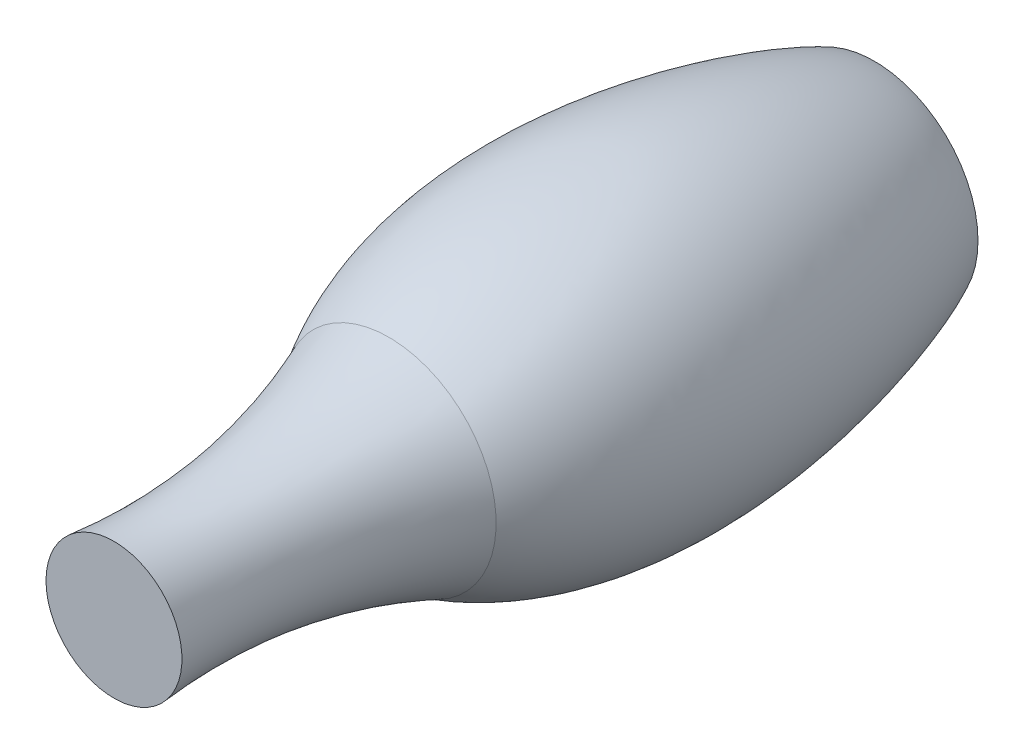
ISO-10303-21;
HEADER;
FILE_DESCRIPTION(('STEP AP214'),'2;1');
FILE_NAME('part.step','',(''),(''),'','','');
FILE_SCHEMA(('AUTOMOTIVE_DESIGN { 1 0 10303 214 1 1 1 1 }'));
ENDSEC;
DATA;
#1=APPLICATION_CONTEXT('core data for automotive mechanical design processes');
#2=APPLICATION_PROTOCOL_DEFINITION('international standard','automotive_design',2000,#1);
#3=PRODUCT_CONTEXT('',#1,'mechanical');
#4=PRODUCT('Part','Part','',(#3));
#5=PRODUCT_RELATED_PRODUCT_CATEGORY('part','',(#4));
#6=PRODUCT_DEFINITION_FORMATION('','',#4);
#7=PRODUCT_DEFINITION_CONTEXT('part definition',#1,'design');
#8=PRODUCT_DEFINITION('design','',#6,#7);
#9=PRODUCT_DEFINITION_SHAPE('','',#8);
#10=(LENGTH_UNIT() NAMED_UNIT(*) SI_UNIT(.MILLI.,.METRE.));
#11=(NAMED_UNIT(*) PLANE_ANGLE_UNIT() SI_UNIT($,.RADIAN.));
#12=(NAMED_UNIT(*) SI_UNIT($,.STERADIAN.) SOLID_ANGLE_UNIT());
#13=UNCERTAINTY_MEASURE_WITH_UNIT(LENGTH_MEASURE(1.E-05),#10,'distance_accuracy_value','');
#14=(GEOMETRIC_REPRESENTATION_CONTEXT(3) GLOBAL_UNCERTAINTY_ASSIGNED_CONTEXT((#13)) GLOBAL_UNIT_ASSIGNED_CONTEXT((#10,
#11,#12)) REPRESENTATION_CONTEXT('',''));
#15=CARTESIAN_POINT('',(0.,0.,0.));
#16=DIRECTION('',(0.,0.,1.));
#17=DIRECTION('',(1.,0.,0.));
#18=AXIS2_PLACEMENT_3D('',#15,#16,#17);
#19=CARTESIAN_POINT('',(983.947861402772,0.,11007.958646251));
#20=DIRECTION('',(0.,0.,-1.));
#21=DIRECTION('',(-1.,0.,0.));
#22=AXIS2_PLACEMENT_3D('',#19,#20,#21);
#23=PLANE('',#22);
#24=CARTESIAN_POINT('',(0.,0.,11007.958646251));
#25=DIRECTION('',(0.,0.,-1.));
#26=DIRECTION('',(-1.,0.,0.));
#27=AXIS2_PLACEMENT_3D('',#24,#25,#26);
#28=CIRCLE('',#27,983.947861402772);
#29=CARTESIAN_POINT('',(-983.947861402772,0.,11007.958646251));
#30=VERTEX_POINT('',#29);
#31=EDGE_CURVE('E10',#30,#30,#28,.T.);
#32=ORIENTED_EDGE('',*,*,#31,.F.);
#33=EDGE_LOOP('',(#32));
#34=FACE_BOUND('',#33,.T.);
#35=ADVANCED_FACE('F33',(#34),#23,.F.);
#36=CARTESIAN_POINT('',(983.947861402772,0.,11007.958646251));
#37=CARTESIAN_POINT('',(778.024635439564,0.,8933.8565343658));
#38=CARTESIAN_POINT('',(1552.78501070839,0.,7028.32632189743));
#39=B_SPLINE_CURVE_WITH_KNOTS('',2,(#36,#37,#38),.UNSPECIFIED.,.F.,.F.,(3,3),(0.,1.),.UNSPECIFIED.);
#40=CARTESIAN_POINT('',(0.,0.,0.));
#41=DIRECTION('',(0.,0.,-1.));
#42=AXIS1_PLACEMENT('',#40,#41);
#43=SURFACE_OF_REVOLUTION('',#39,#42);
#44=CARTESIAN_POINT('',(0.,0.,7028.32632189743));
#45=DIRECTION('',(0.,0.,-1.));
#46=DIRECTION('',(-1.,0.,0.));
#47=AXIS2_PLACEMENT_3D('',#44,#45,#46);
#48=CIRCLE('',#47,1552.78501070839);
#49=CARTESIAN_POINT('',(-1552.78501070839,0.,7028.32632189743));
#50=VERTEX_POINT('',#49);
#51=EDGE_CURVE('E39',#50,#50,#48,.T.);
#52=ORIENTED_EDGE('',*,*,#51,.F.);
#53=EDGE_LOOP('',(#52));
#54=FACE_BOUND('',#53,.T.);
#55=ORIENTED_EDGE('',*,*,#31,.T.);
#56=EDGE_LOOP('',(#55));
#57=FACE_BOUND('',#56,.T.);
#58=ADVANCED_FACE('F66',(#54,#57),#43,.T.);
#59=CARTESIAN_POINT('',(1552.78501070839,0.,7028.32632189743));
#60=CARTESIAN_POINT('',(3061.46167226128,0.,4517.41495373928));
#61=CARTESIAN_POINT('',(1901.18253115252,0.,776.853983432614));
#62=CARTESIAN_POINT('',(1500.,0.,0.));
#63=B_SPLINE_CURVE_WITH_KNOTS('',3,(#59,#60,#61,#62),.UNSPECIFIED.,.F.,.F.,(4,4),(0.,1.),.UNSPECIFIED.);
#64=CARTESIAN_POINT('',(0.,0.,0.));
#65=DIRECTION('',(0.,0.,-1.));
#66=AXIS1_PLACEMENT('',#64,#65);
#67=SURFACE_OF_REVOLUTION('',#63,#66);
#68=CARTESIAN_POINT('',(0.,0.,0.));
#69=DIRECTION('',(0.,0.,-1.));
#70=DIRECTION('',(-1.,0.,0.));
#71=AXIS2_PLACEMENT_3D('',#68,#69,#70);
#72=CIRCLE('',#71,1500.);
#73=CARTESIAN_POINT('',(-1500.,0.,0.));
#74=VERTEX_POINT('',#73);
#75=EDGE_CURVE('E43',#74,#74,#72,.T.);
#76=ORIENTED_EDGE('',*,*,#75,.F.);
#77=EDGE_LOOP('',(#76));
#78=FACE_BOUND('',#77,.T.);
#79=ORIENTED_EDGE('',*,*,#51,.T.);
#80=EDGE_LOOP('',(#79));
#81=FACE_BOUND('',#80,.T.);
#82=ADVANCED_FACE('F62',(#78,#81),#67,.T.);
#83=CARTESIAN_POINT('',(0.,0.,0.));
#84=DIRECTION('',(0.,0.,1.));
#85=DIRECTION('',(1.,0.,0.));
#86=AXIS2_PLACEMENT_3D('',#83,#84,#85);
#87=PLANE('',#86);
#88=CARTESIAN_POINT('',(0.,0.,0.));
#89=DIRECTION('',(0.,0.,-1.));
#90=DIRECTION('',(-1.,0.,0.));
#91=AXIS2_PLACEMENT_3D('',#88,#89,#90);
#92=CIRCLE('',#91,1250.);
#93=CARTESIAN_POINT('',(-1250.,0.,0.));
#94=VERTEX_POINT('',#93);
#95=EDGE_CURVE('E250',#94,#94,#92,.T.);
#96=ORIENTED_EDGE('',*,*,#95,.F.);
#97=EDGE_LOOP('',(#96));
#98=FACE_BOUND('',#97,.T.);
#99=ORIENTED_EDGE('',*,*,#75,.T.);
#100=EDGE_LOOP('',(#99));
#101=FACE_BOUND('',#100,.T.);
#102=ADVANCED_FACE('F65',(#98,#101),#87,.F.);
#103=CARTESIAN_POINT('',(0.,0.,250.));
#104=DIRECTION('',(0.,0.,-1.));
#105=DIRECTION('',(-1.,0.,0.));
#106=AXIS2_PLACEMENT_3D('',#103,#104,#105);
#107=CYLINDRICAL_SURFACE('',#106,1250.);
#108=CARTESIAN_POINT('',(0.,0.,250.));
#109=DIRECTION('',(0.,0.,-1.));
#110=DIRECTION('',(-1.,0.,0.));
#111=AXIS2_PLACEMENT_3D('',#108,#109,#110);
#112=CIRCLE('',#111,1250.);
#113=CARTESIAN_POINT('',(-1250.,0.,250.));
#114=VERTEX_POINT('',#113);
#115=EDGE_CURVE('E47',#114,#114,#112,.T.);
#116=ORIENTED_EDGE('',*,*,#115,.F.);
#117=EDGE_LOOP('',(#116));
#118=FACE_BOUND('',#117,.T.);
#119=ORIENTED_EDGE('',*,*,#95,.T.);
#120=EDGE_LOOP('',(#119));
#121=FACE_BOUND('',#120,.T.);
#122=ADVANCED_FACE('F92',(#118,#121),#107,.F.);
#123=CARTESIAN_POINT('',(0.,0.,250.));
#124=DIRECTION('',(0.,0.,-1.));
#125=DIRECTION('',(-1.,0.,0.));
#126=AXIS2_PLACEMENT_3D('',#123,#124,#125);
#127=PLANE('',#126);
#128=CARTESIAN_POINT('',(-400.277267379666,-693.300564216395,250.));
#129=DIRECTION('',(0.,0.,-1.));
#130=DIRECTION('',(-1.,0.,0.));
#131=AXIS2_PLACEMENT_3D('',#128,#129,#130);
#132=CIRCLE('',#131,300.);
#133=CARTESIAN_POINT('',(-700.277267379666,-693.300564216395,250.));
#134=VERTEX_POINT('',#133);
#135=EDGE_CURVE('E282',#134,#134,#132,.T.);
#136=ORIENTED_EDGE('',*,*,#135,.F.);
#137=EDGE_LOOP('',(#136));
#138=FACE_BOUND('',#137,.T.);
#139=CARTESIAN_POINT('',(400.277267379652,-693.300564216404,250.));
#140=DIRECTION('',(0.,0.,-1.));
#141=DIRECTION('',(-1.,0.,0.));
#142=AXIS2_PLACEMENT_3D('',#139,#140,#141);
#143=CIRCLE('',#142,300.);
#144=CARTESIAN_POINT('',(100.277267379651,-693.300564216404,250.));
#145=VERTEX_POINT('',#144);
#146=EDGE_CURVE('E276',#145,#145,#143,.T.);
#147=ORIENTED_EDGE('',*,*,#146,.F.);
#148=EDGE_LOOP('',(#147));
#149=FACE_BOUND('',#148,.T.);
#150=CARTESIAN_POINT('',(800.554534759316,-5.5902424376768E-12,250.));
#151=DIRECTION('',(0.,0.,-1.));
#152=DIRECTION('',(-1.,0.,0.));
#153=AXIS2_PLACEMENT_3D('',#150,#151,#152);
#154=CIRCLE('',#153,300.);
#155=CARTESIAN_POINT('',(500.554534759316,-5.5902424376768E-12,250.));
#156=VERTEX_POINT('',#155);
#157=EDGE_CURVE('E270',#156,#156,#154,.T.);
#158=ORIENTED_EDGE('',*,*,#157,.F.);
#159=EDGE_LOOP('',(#158));
#160=FACE_BOUND('',#159,.T.);
#161=CARTESIAN_POINT('',(400.277267379661,693.300564216398,250.));
#162=DIRECTION('',(0.,0.,-1.));
#163=DIRECTION('',(-1.,0.,0.));
#164=AXIS2_PLACEMENT_3D('',#161,#162,#163);
#165=CIRCLE('',#164,300.);
#166=CARTESIAN_POINT('',(100.277267379661,693.300564216398,250.));
#167=VERTEX_POINT('',#166);
#168=EDGE_CURVE('E263',#167,#167,#165,.T.);
#169=ORIENTED_EDGE('',*,*,#168,.F.);
#170=EDGE_LOOP('',(#169));
#171=FACE_BOUND('',#170,.T.);
#172=CARTESIAN_POINT('',(-400.277267379656,693.300564216401,250.));
#173=DIRECTION('',(0.,0.,-1.));
#174=DIRECTION('',(-1.,0.,0.));
#175=AXIS2_PLACEMENT_3D('',#172,#173,#174);
#176=CIRCLE('',#175,300.);
#177=CARTESIAN_POINT('',(-700.277267379656,693.300564216401,250.));
#178=VERTEX_POINT('',#177);
#179=EDGE_CURVE('E287',#178,#178,#176,.T.);
#180=ORIENTED_EDGE('',*,*,#179,.F.);
#181=EDGE_LOOP('',(#180));
#182=FACE_BOUND('',#181,.T.);
#183=CARTESIAN_POINT('',(-800.554534759316,0.,250.));
#184=DIRECTION('',(0.,0.,-1.));
#185=DIRECTION('',(-1.,0.,0.));
#186=AXIS2_PLACEMENT_3D('',#183,#184,#185);
#187=CIRCLE('',#186,300.);
#188=CARTESIAN_POINT('',(-1100.55453475932,0.,250.));
#189=VERTEX_POINT('',#188);
#190=EDGE_CURVE('E257',#189,#189,#187,.T.);
#191=ORIENTED_EDGE('',*,*,#190,.F.);
#192=EDGE_LOOP('',(#191));
#193=FACE_BOUND('',#192,.T.);
#194=ORIENTED_EDGE('',*,*,#115,.T.);
#195=EDGE_LOOP('',(#194));
#196=FACE_BOUND('',#195,.T.);
#197=ADVANCED_FACE('F96',(#138,#149,#160,#171,#182,#193,#196),#127,.T.);
#198=CARTESIAN_POINT('',(-800.554534759316,0.,500.));
#199=DIRECTION('',(0.,0.,-1.));
#200=DIRECTION('',(-1.,0.,0.));
#201=AXIS2_PLACEMENT_3D('',#198,#199,#200);
#202=CYLINDRICAL_SURFACE('',#201,300.);
#203=CARTESIAN_POINT('',(-800.554534759316,0.,500.));
#204=DIRECTION('',(0.,0.,-1.));
#205=DIRECTION('',(-1.,0.,0.));
#206=AXIS2_PLACEMENT_3D('',#203,#204,#205);
#207=CIRCLE('',#206,300.);
#208=CARTESIAN_POINT('',(-1100.55453475932,0.,500.));
#209=VERTEX_POINT('',#208);
#210=EDGE_CURVE('E253',#209,#209,#207,.T.);
#211=ORIENTED_EDGE('',*,*,#210,.F.);
#212=EDGE_LOOP('',(#211));
#213=FACE_BOUND('',#212,.T.);
#214=ORIENTED_EDGE('',*,*,#190,.T.);
#215=EDGE_LOOP('',(#214));
#216=FACE_BOUND('',#215,.T.);
#217=ADVANCED_FACE('F107',(#213,#216),#202,.F.);
#218=CARTESIAN_POINT('',(-800.554534759316,0.,500.));
#219=DIRECTION('',(0.,0.,-1.));
#220=DIRECTION('',(-1.,0.,0.));
#221=AXIS2_PLACEMENT_3D('',#218,#219,#220);
#222=PLANE('',#221);
#223=ORIENTED_EDGE('',*,*,#210,.T.);
#224=EDGE_LOOP('',(#223));
#225=FACE_BOUND('',#224,.T.);
#226=ADVANCED_FACE('F115',(#225),#222,.T.);
#227=CARTESIAN_POINT('',(-400.277267379656,693.300564216401,500.));
#228=DIRECTION('',(0.,0.,-1.));
#229=DIRECTION('',(-1.,0.,0.));
#230=AXIS2_PLACEMENT_3D('',#227,#228,#229);
#231=CYLINDRICAL_SURFACE('',#230,300.);
#232=CARTESIAN_POINT('',(-400.277267379656,693.300564216401,500.));
#233=DIRECTION('',(0.,0.,-1.));
#234=DIRECTION('',(-1.,0.,0.));
#235=AXIS2_PLACEMENT_3D('',#232,#233,#234);
#236=CIRCLE('',#235,300.);
#237=CARTESIAN_POINT('',(-700.277267379656,693.300564216401,500.));
#238=VERTEX_POINT('',#237);
#239=EDGE_CURVE('E267',#238,#238,#236,.T.);
#240=ORIENTED_EDGE('',*,*,#239,.F.);
#241=EDGE_LOOP('',(#240));
#242=FACE_BOUND('',#241,.T.);
#243=ORIENTED_EDGE('',*,*,#179,.T.);
#244=EDGE_LOOP('',(#243));
#245=FACE_BOUND('',#244,.T.);
#246=ADVANCED_FACE('F123',(#242,#245),#231,.F.);
#247=CARTESIAN_POINT('',(-400.277267379656,693.300564216401,500.));
#248=DIRECTION('',(0.,0.,-1.));
#249=DIRECTION('',(-1.,0.,0.));
#250=AXIS2_PLACEMENT_3D('',#247,#248,#249);
#251=PLANE('',#250);
#252=ORIENTED_EDGE('',*,*,#239,.T.);
#253=EDGE_LOOP('',(#252));
#254=FACE_BOUND('',#253,.T.);
#255=ADVANCED_FACE('F131',(#254),#251,.T.);
#256=CARTESIAN_POINT('',(400.277267379661,693.300564216398,500.));
#257=DIRECTION('',(0.,0.,-1.));
#258=DIRECTION('',(-1.,0.,0.));
#259=AXIS2_PLACEMENT_3D('',#256,#257,#258);
#260=CYLINDRICAL_SURFACE('',#259,300.);
#261=CARTESIAN_POINT('',(400.277267379661,693.300564216398,500.));
#262=DIRECTION('',(0.,0.,-1.));
#263=DIRECTION('',(-1.,0.,0.));
#264=AXIS2_PLACEMENT_3D('',#261,#262,#263);
#265=CIRCLE('',#264,300.);
#266=CARTESIAN_POINT('',(100.277267379661,693.300564216398,500.));
#267=VERTEX_POINT('',#266);
#268=EDGE_CURVE('E266',#267,#267,#265,.T.);
#269=ORIENTED_EDGE('',*,*,#268,.F.);
#270=EDGE_LOOP('',(#269));
#271=FACE_BOUND('',#270,.T.);
#272=ORIENTED_EDGE('',*,*,#168,.T.);
#273=EDGE_LOOP('',(#272));
#274=FACE_BOUND('',#273,.T.);
#275=ADVANCED_FACE('F139',(#271,#274),#260,.F.);
#276=CARTESIAN_POINT('',(400.277267379661,693.300564216398,500.));
#277=DIRECTION('',(0.,0.,-1.));
#278=DIRECTION('',(-1.,0.,0.));
#279=AXIS2_PLACEMENT_3D('',#276,#277,#278);
#280=PLANE('',#279);
#281=ORIENTED_EDGE('',*,*,#268,.T.);
#282=EDGE_LOOP('',(#281));
#283=FACE_BOUND('',#282,.T.);
#284=ADVANCED_FACE('F147',(#283),#280,.T.);
#285=CARTESIAN_POINT('',(800.554534759316,-5.5902424376768E-12,500.));
#286=DIRECTION('',(0.,0.,-1.));
#287=DIRECTION('',(-1.,0.,0.));
#288=AXIS2_PLACEMENT_3D('',#285,#286,#287);
#289=CYLINDRICAL_SURFACE('',#288,300.);
#290=CARTESIAN_POINT('',(800.554534759316,-5.5902424376768E-12,500.));
#291=DIRECTION('',(0.,0.,-1.));
#292=DIRECTION('',(-1.,0.,0.));
#293=AXIS2_PLACEMENT_3D('',#290,#291,#292);
#294=CIRCLE('',#293,300.);
#295=CARTESIAN_POINT('',(500.554534759316,-5.5902424376768E-12,500.));
#296=VERTEX_POINT('',#295);
#297=EDGE_CURVE('E273',#296,#296,#294,.T.);
#298=ORIENTED_EDGE('',*,*,#297,.F.);
#299=EDGE_LOOP('',(#298));
#300=FACE_BOUND('',#299,.T.);
#301=ORIENTED_EDGE('',*,*,#157,.T.);
#302=EDGE_LOOP('',(#301));
#303=FACE_BOUND('',#302,.T.);
#304=ADVANCED_FACE('F155',(#300,#303),#289,.F.);
#305=CARTESIAN_POINT('',(800.554534759316,-5.5902424376768E-12,500.));
#306=DIRECTION('',(0.,0.,-1.));
#307=DIRECTION('',(-1.,0.,0.));
#308=AXIS2_PLACEMENT_3D('',#305,#306,#307);
#309=PLANE('',#308);
#310=ORIENTED_EDGE('',*,*,#297,.T.);
#311=EDGE_LOOP('',(#310));
#312=FACE_BOUND('',#311,.T.);
#313=ADVANCED_FACE('F163',(#312),#309,.T.);
#314=CARTESIAN_POINT('',(400.277267379652,-693.300564216404,500.));
#315=DIRECTION('',(0.,0.,-1.));
#316=DIRECTION('',(-1.,0.,0.));
#317=AXIS2_PLACEMENT_3D('',#314,#315,#316);
#318=CYLINDRICAL_SURFACE('',#317,300.);
#319=CARTESIAN_POINT('',(400.277267379652,-693.300564216404,500.));
#320=DIRECTION('',(0.,0.,-1.));
#321=DIRECTION('',(-1.,0.,0.));
#322=AXIS2_PLACEMENT_3D('',#319,#320,#321);
#323=CIRCLE('',#322,300.);
#324=CARTESIAN_POINT('',(100.277267379651,-693.300564216404,500.));
#325=VERTEX_POINT('',#324);
#326=EDGE_CURVE('E279',#325,#325,#323,.T.);
#327=ORIENTED_EDGE('',*,*,#326,.F.);
#328=EDGE_LOOP('',(#327));
#329=FACE_BOUND('',#328,.T.);
#330=ORIENTED_EDGE('',*,*,#146,.T.);
#331=EDGE_LOOP('',(#330));
#332=FACE_BOUND('',#331,.T.);
#333=ADVANCED_FACE('F171',(#329,#332),#318,.F.);
#334=CARTESIAN_POINT('',(400.277267379652,-693.300564216404,500.));
#335=DIRECTION('',(0.,0.,-1.));
#336=DIRECTION('',(-1.,0.,0.));
#337=AXIS2_PLACEMENT_3D('',#334,#335,#336);
#338=PLANE('',#337);
#339=ORIENTED_EDGE('',*,*,#326,.T.);
#340=EDGE_LOOP('',(#339));
#341=FACE_BOUND('',#340,.T.);
#342=ADVANCED_FACE('F179',(#341),#338,.T.);
#343=CARTESIAN_POINT('',(-400.277267379666,-693.300564216395,500.));
#344=DIRECTION('',(0.,0.,-1.));
#345=DIRECTION('',(-1.,0.,0.));
#346=AXIS2_PLACEMENT_3D('',#343,#344,#345);
#347=CYLINDRICAL_SURFACE('',#346,300.);
#348=CARTESIAN_POINT('',(-400.277267379666,-693.300564216395,500.));
#349=DIRECTION('',(0.,0.,-1.));
#350=DIRECTION('',(-1.,0.,0.));
#351=AXIS2_PLACEMENT_3D('',#348,#349,#350);
#352=CIRCLE('',#351,300.);
#353=CARTESIAN_POINT('',(-700.277267379666,-693.300564216395,500.));
#354=VERTEX_POINT('',#353);
#355=EDGE_CURVE('E261',#354,#354,#352,.T.);
#356=ORIENTED_EDGE('',*,*,#355,.F.);
#357=EDGE_LOOP('',(#356));
#358=FACE_BOUND('',#357,.T.);
#359=ORIENTED_EDGE('',*,*,#135,.T.);
#360=EDGE_LOOP('',(#359));
#361=FACE_BOUND('',#360,.T.);
#362=ADVANCED_FACE('F187',(#358,#361),#347,.F.);
#363=CARTESIAN_POINT('',(-400.277267379666,-693.300564216395,500.));
#364=DIRECTION('',(0.,0.,-1.));
#365=DIRECTION('',(-1.,0.,0.));
#366=AXIS2_PLACEMENT_3D('',#363,#364,#365);
#367=PLANE('',#366);
#368=ORIENTED_EDGE('',*,*,#355,.T.);
#369=EDGE_LOOP('',(#368));
#370=FACE_BOUND('',#369,.T.);
#371=ADVANCED_FACE('F195',(#370),#367,.T.);
#372=CLOSED_SHELL('',(#35,#58,#82,#102,#122,#197,#217,#226,#246,#255,#275,#284,#304,#313,#333,
#342,#362,#371));
#373=MANIFOLD_SOLID_BREP('B2',#372);
#374=ADVANCED_BREP_SHAPE_REPRESENTATION('',(#18,#373),#14);
#375=SHAPE_DEFINITION_REPRESENTATION(#9,#374);
ENDSEC;
END-ISO-10303-21;
